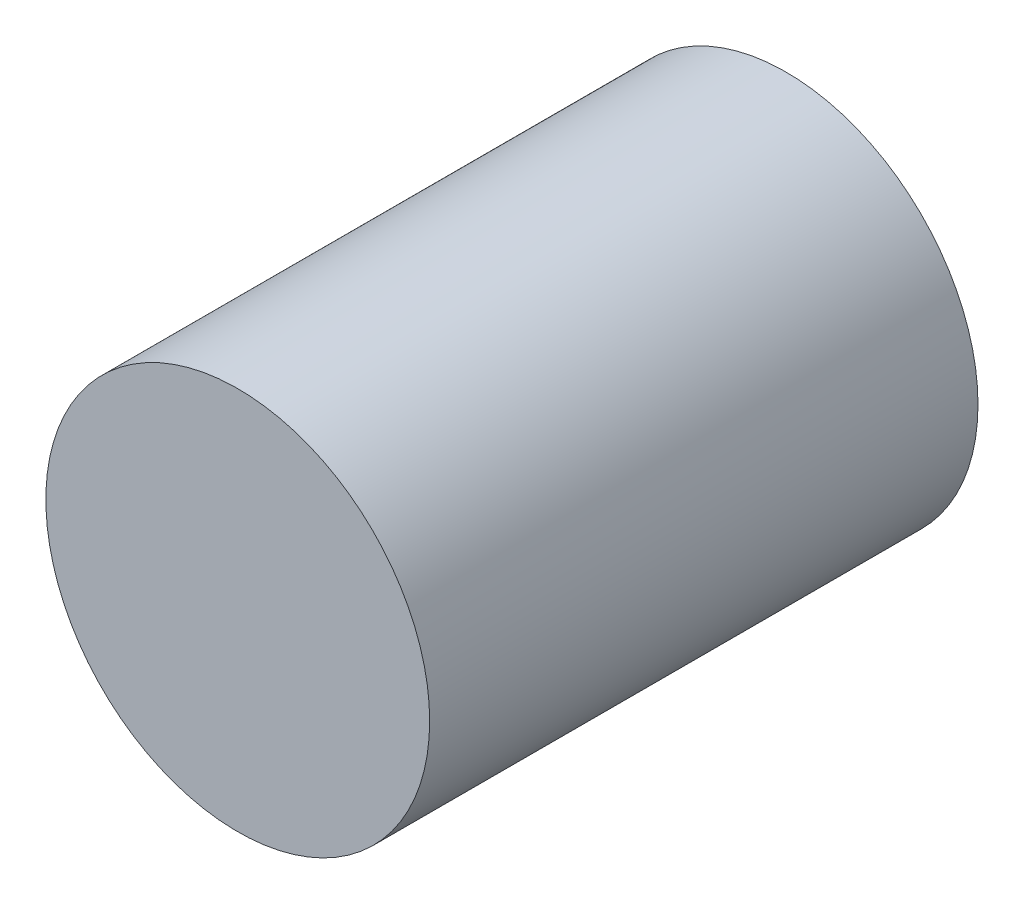
ISO-10303-21;
HEADER;
FILE_DESCRIPTION(('STEP AP214'),'2;1');
FILE_NAME('part.step','',(''),(''),'','','');
FILE_SCHEMA(('AUTOMOTIVE_DESIGN { 1 0 10303 214 1 1 1 1 }'));
ENDSEC;
DATA;
#1=APPLICATION_CONTEXT('core data for automotive mechanical design processes');
#2=APPLICATION_PROTOCOL_DEFINITION('international standard','automotive_design',2000,#1);
#3=PRODUCT_CONTEXT('',#1,'mechanical');
#4=PRODUCT('Part','Part','',(#3));
#5=PRODUCT_RELATED_PRODUCT_CATEGORY('part','',(#4));
#6=PRODUCT_DEFINITION_FORMATION('','',#4);
#7=PRODUCT_DEFINITION_CONTEXT('part definition',#1,'design');
#8=PRODUCT_DEFINITION('design','',#6,#7);
#9=PRODUCT_DEFINITION_SHAPE('','',#8);
#10=(LENGTH_UNIT() NAMED_UNIT(*) SI_UNIT(.MILLI.,.METRE.));
#11=(NAMED_UNIT(*) PLANE_ANGLE_UNIT() SI_UNIT($,.RADIAN.));
#12=(NAMED_UNIT(*) SI_UNIT($,.STERADIAN.) SOLID_ANGLE_UNIT());
#13=UNCERTAINTY_MEASURE_WITH_UNIT(LENGTH_MEASURE(1.E-05),#10,'distance_accuracy_value','');
#14=(GEOMETRIC_REPRESENTATION_CONTEXT(3) GLOBAL_UNCERTAINTY_ASSIGNED_CONTEXT((#13)) GLOBAL_UNIT_ASSIGNED_CONTEXT((#10,
#11,#12)) REPRESENTATION_CONTEXT('',''));
#15=CARTESIAN_POINT('',(0.,0.,0.));
#16=DIRECTION('',(0.,0.,1.));
#17=DIRECTION('',(1.,0.,0.));
#18=AXIS2_PLACEMENT_3D('',#15,#16,#17);
#19=CARTESIAN_POINT('',(0.,0.,5.));
#20=DIRECTION('',(0.,0.,-1.));
#21=DIRECTION('',(-1.,0.,0.));
#22=AXIS2_PLACEMENT_3D('',#19,#20,#21);
#23=CYLINDRICAL_SURFACE('',#22,1.75);
#24=CARTESIAN_POINT('',(0.,0.,5.));
#25=DIRECTION('',(0.,0.,1.));
#26=DIRECTION('',(1.,0.,0.));
#27=AXIS2_PLACEMENT_3D('',#24,#25,#26);
#28=CIRCLE('',#27,1.75);
#29=CARTESIAN_POINT('',(1.75,0.,5.));
#30=VERTEX_POINT('',#29);
#31=EDGE_CURVE('E10',#30,#30,#28,.T.);
#32=ORIENTED_EDGE('',*,*,#31,.F.);
#33=EDGE_LOOP('',(#32));
#34=FACE_BOUND('',#33,.T.);
#35=CARTESIAN_POINT('',(0.,0.,0.));
#36=DIRECTION('',(0.,0.,1.));
#37=DIRECTION('',(1.,0.,0.));
#38=AXIS2_PLACEMENT_3D('',#35,#36,#37);
#39=CIRCLE('',#38,1.75);
#40=CARTESIAN_POINT('',(1.75,0.,0.));
#41=VERTEX_POINT('',#40);
#42=EDGE_CURVE('E34',#41,#41,#39,.T.);
#43=ORIENTED_EDGE('',*,*,#42,.T.);
#44=EDGE_LOOP('',(#43));
#45=FACE_BOUND('',#44,.T.);
#46=ADVANCED_FACE('F31',(#34,#45),#23,.T.);
#47=CARTESIAN_POINT('',(0.,0.,5.));
#48=DIRECTION('',(0.,0.,1.));
#49=DIRECTION('',(1.,0.,0.));
#50=AXIS2_PLACEMENT_3D('',#47,#48,#49);
#51=PLANE('',#50);
#52=ORIENTED_EDGE('',*,*,#31,.T.);
#53=EDGE_LOOP('',(#52));
#54=FACE_BOUND('',#53,.T.);
#55=ADVANCED_FACE('F46',(#54),#51,.T.);
#56=CARTESIAN_POINT('',(0.,0.,0.));
#57=DIRECTION('',(0.,0.,1.));
#58=DIRECTION('',(1.,0.,0.));
#59=AXIS2_PLACEMENT_3D('',#56,#57,#58);
#60=PLANE('',#59);
#61=ORIENTED_EDGE('',*,*,#42,.F.);
#62=EDGE_LOOP('',(#61));
#63=FACE_BOUND('',#62,.T.);
#64=ADVANCED_FACE('F44',(#63),#60,.F.);
#65=CLOSED_SHELL('',(#46,#55,#64));
#66=MANIFOLD_SOLID_BREP('B2',#65);
#67=ADVANCED_BREP_SHAPE_REPRESENTATION('',(#18,#66),#14);
#68=SHAPE_DEFINITION_REPRESENTATION(#9,#67);
ENDSEC;
END-ISO-10303-21;
